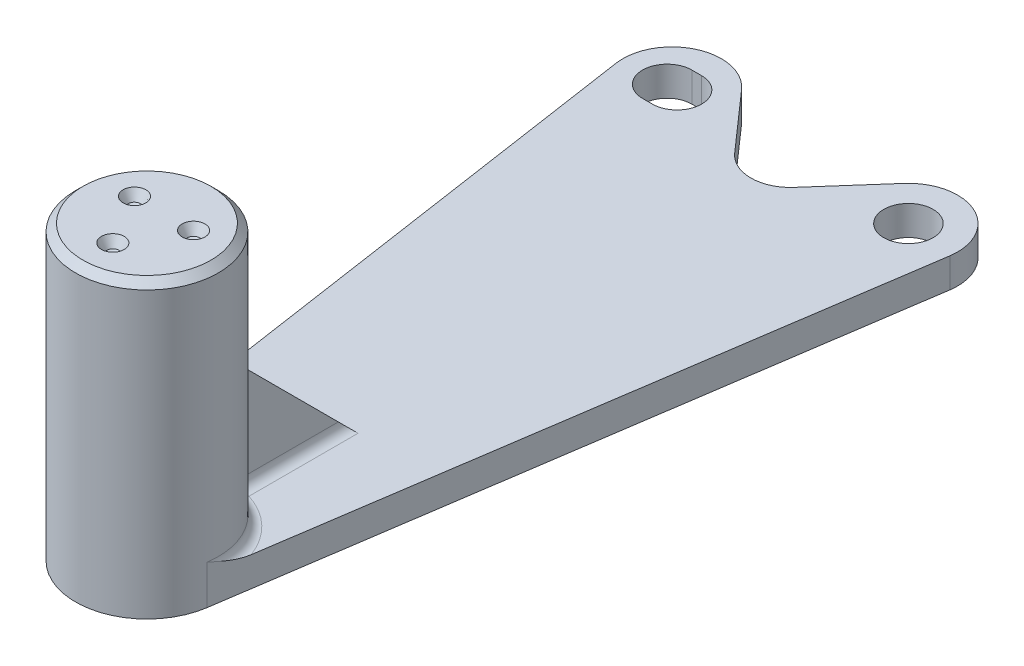
ISO-10303-21;
HEADER;
FILE_DESCRIPTION(('STEP AP214'),'2;1');
FILE_NAME('part.step','',(''),(''),'','','');
FILE_SCHEMA(('AUTOMOTIVE_DESIGN { 1 0 10303 214 1 1 1 1 }'));
ENDSEC;
DATA;
#1=APPLICATION_CONTEXT('core data for automotive mechanical design processes');
#2=APPLICATION_PROTOCOL_DEFINITION('international standard','automotive_design',2000,#1);
#3=PRODUCT_CONTEXT('',#1,'mechanical');
#4=PRODUCT('Part','Part','',(#3));
#5=PRODUCT_RELATED_PRODUCT_CATEGORY('part','',(#4));
#6=PRODUCT_DEFINITION_FORMATION('','',#4);
#7=PRODUCT_DEFINITION_CONTEXT('part definition',#1,'design');
#8=PRODUCT_DEFINITION('design','',#6,#7);
#9=PRODUCT_DEFINITION_SHAPE('','',#8);
#10=(LENGTH_UNIT() NAMED_UNIT(*) SI_UNIT(.MILLI.,.METRE.));
#11=(NAMED_UNIT(*) PLANE_ANGLE_UNIT() SI_UNIT($,.RADIAN.));
#12=(NAMED_UNIT(*) SI_UNIT($,.STERADIAN.) SOLID_ANGLE_UNIT());
#13=UNCERTAINTY_MEASURE_WITH_UNIT(LENGTH_MEASURE(1.E-05),#10,'distance_accuracy_value','');
#14=(GEOMETRIC_REPRESENTATION_CONTEXT(3) GLOBAL_UNCERTAINTY_ASSIGNED_CONTEXT((#13)) GLOBAL_UNIT_ASSIGNED_CONTEXT((#10,
#11,#12)) REPRESENTATION_CONTEXT('',''));
#15=CARTESIAN_POINT('',(0.,0.,0.));
#16=DIRECTION('',(0.,0.,1.));
#17=DIRECTION('',(1.,0.,0.));
#18=AXIS2_PLACEMENT_3D('',#15,#16,#17);
#19=CARTESIAN_POINT('',(0.,-119.23719330882,200.655577655365));
#20=DIRECTION('',(0.,1.,0.));
#21=DIRECTION('',(0.,0.,1.));
#22=AXIS2_PLACEMENT_3D('',#19,#20,#21);
#23=CYLINDRICAL_SURFACE('',#22,14.5);
#24=CARTESIAN_POINT('',(0.,-20.3479111694278,200.655577655365));
#25=DIRECTION('',(0.,1.,0.));
#26=DIRECTION('',(0.,0.,1.));
#27=AXIS2_PLACEMENT_3D('',#24,#25,#26);
#28=CIRCLE('',#27,14.5);
#29=CARTESIAN_POINT('',(0.,-20.3479111694278,186.155577655365));
#30=VERTEX_POINT('',#29);
#31=EDGE_CURVE('E317',#30,#30,#28,.F.);
#32=ORIENTED_EDGE('',*,*,#31,.T.);
#33=EDGE_LOOP('',(#32));
#34=FACE_BOUND('',#33,.T.);
#35=DIRECTION('',(0.,-1.,0.));
#36=VECTOR('',#35,1.);
#37=CARTESIAN_POINT('',(14.3419504002257,-72.225,202.790632389433));
#38=LINE('',#37,#36);
#39=CARTESIAN_POINT('',(14.3419504002258,-70.225,202.790632389433));
#40=VERTEX_POINT('',#39);
#41=CARTESIAN_POINT('',(14.3419504002258,-78.225,202.790632389433));
#42=VERTEX_POINT('',#41);
#43=EDGE_CURVE('E207',#40,#42,#38,.T.);
#44=ORIENTED_EDGE('',*,*,#43,.F.);
#45=CARTESIAN_POINT('',(0.,-70.225,200.655577655365));
#46=DIRECTION('',(0.,-1.,0.));
#47=DIRECTION('',(0.,0.,-1.));
#48=AXIS2_PLACEMENT_3D('',#45,#46,#47);
#49=CIRCLE('',#48,14.5);
#50=CARTESIAN_POINT('',(4.39393939393936,-70.225,186.837354303487));
#51=VERTEX_POINT('',#50);
#52=EDGE_CURVE('E341',#40,#51,#49,.F.);
#53=ORIENTED_EDGE('',*,*,#52,.T.);
#54=DIRECTION('',(0.,1.,0.));
#55=VECTOR('',#54,1.);
#56=CARTESIAN_POINT('',(4.39393939393936,-119.23719330882,186.837354303487));
#57=LINE('',#56,#55);
#58=CARTESIAN_POINT('',(4.39393939393936,-48.1782780859458,186.837354303487));
#59=VERTEX_POINT('',#58);
#60=EDGE_CURVE('E338',#51,#59,#57,.T.);
#61=ORIENTED_EDGE('',*,*,#60,.T.);
#62=CARTESIAN_POINT('',(0.,-34.3600547340679,200.655577655365));
#63=DIRECTION('',(0.,0.707106781186551,-0.707106781186544));
#64=DIRECTION('',(0.,0.707106781186544,0.707106781186551));
#65=AXIS2_PLACEMENT_3D('',#62,#63,#64);
#66=ELLIPSE('',#65,20.5060966544098,14.5);
#67=CARTESIAN_POINT('',(-4.39393939393943,-48.1782780859458,186.837354303487));
#68=VERTEX_POINT('',#67);
#69=EDGE_CURVE('E219',#68,#59,#66,.F.);
#70=ORIENTED_EDGE('',*,*,#69,.F.);
#71=DIRECTION('',(0.,1.,0.));
#72=VECTOR('',#71,1.);
#73=CARTESIAN_POINT('',(-4.39393939393943,-119.23719330882,186.837354303487));
#74=LINE('',#73,#72);
#75=CARTESIAN_POINT('',(-4.39393939393943,-70.225,186.837354303487));
#76=VERTEX_POINT('',#75);
#77=EDGE_CURVE('E333',#68,#76,#74,.F.);
#78=ORIENTED_EDGE('',*,*,#77,.T.);
#79=CARTESIAN_POINT('',(0.,-70.225,200.655577655365));
#80=DIRECTION('',(0.,-1.,0.));
#81=DIRECTION('',(0.,0.,-1.));
#82=AXIS2_PLACEMENT_3D('',#79,#80,#81);
#83=CIRCLE('',#82,14.5);
#84=CARTESIAN_POINT('',(-14.3419504002258,-70.225,202.790632389433));
#85=VERTEX_POINT('',#84);
#86=EDGE_CURVE('E335',#76,#85,#83,.F.);
#87=ORIENTED_EDGE('',*,*,#86,.T.);
#88=DIRECTION('',(0.,-1.,0.));
#89=VECTOR('',#88,1.);
#90=CARTESIAN_POINT('',(-14.3419504002257,-72.225,202.790632389433));
#91=LINE('',#90,#89);
#92=CARTESIAN_POINT('',(-14.3419504002257,-78.225,202.790632389433));
#93=VERTEX_POINT('',#92);
#94=EDGE_CURVE('E291',#85,#93,#91,.T.);
#95=ORIENTED_EDGE('',*,*,#94,.T.);
#96=CARTESIAN_POINT('',(0.,-78.225,200.655577655365));
#97=DIRECTION('',(0.,-1.,0.));
#98=DIRECTION('',(0.,0.,-1.));
#99=AXIS2_PLACEMENT_3D('',#96,#97,#98);
#100=CIRCLE('',#99,14.5);
#101=EDGE_CURVE('E312',#93,#42,#100,.F.);
#102=ORIENTED_EDGE('',*,*,#101,.T.);
#103=EDGE_LOOP('',(#44,#53,#61,#70,#78,#87,#95,#102));
#104=FACE_BOUND('',#103,.T.);
#105=ADVANCED_FACE('F45',(#34,#104),#23,.T.);
#106=CARTESIAN_POINT('',(0.,-72.225,0.));
#107=DIRECTION('',(0.,-1.,0.));
#108=DIRECTION('',(0.,0.,-1.));
#109=AXIS2_PLACEMENT_3D('',#106,#107,#108);
#110=PLANE('',#109);
#111=CARTESIAN_POINT('',(24.,-72.225,70.));
#112=DIRECTION('',(0.,-1.,0.));
#113=DIRECTION('',(0.,0.,-1.));
#114=AXIS2_PLACEMENT_3D('',#111,#112,#113);
#115=CIRCLE('',#114,5.);
#116=CARTESIAN_POINT('',(24.,-72.225,65.));
#117=VERTEX_POINT('',#116);
#118=EDGE_CURVE('E208',#117,#117,#115,.T.);
#119=ORIENTED_EDGE('',*,*,#118,.T.);
#120=EDGE_LOOP('',(#119));
#121=FACE_BOUND('',#120,.T.);
#122=CARTESIAN_POINT('',(-25.,-72.225,70.));
#123=DIRECTION('',(0.,-1.,0.));
#124=DIRECTION('',(0.,0.,-1.));
#125=AXIS2_PLACEMENT_3D('',#122,#123,#124);
#126=CIRCLE('',#125,5.);
#127=CARTESIAN_POINT('',(-25.,-72.225,75.));
#128=VERTEX_POINT('',#127);
#129=CARTESIAN_POINT('',(-25.,-72.225,65.));
#130=VERTEX_POINT('',#129);
#131=EDGE_CURVE('E233',#128,#130,#126,.T.);
#132=ORIENTED_EDGE('',*,*,#131,.T.);
#133=DIRECTION('',(-1.,0.,0.));
#134=VECTOR('',#133,1.);
#135=CARTESIAN_POINT('',(0.,-72.225,65.));
#136=LINE('',#135,#134);
#137=CARTESIAN_POINT('',(-23.,-72.225,65.));
#138=VERTEX_POINT('',#137);
#139=EDGE_CURVE('E239',#138,#130,#136,.T.);
#140=ORIENTED_EDGE('',*,*,#139,.F.);
#141=CARTESIAN_POINT('',(-23.,-72.225,70.));
#142=DIRECTION('',(0.,-1.,0.));
#143=DIRECTION('',(0.,0.,-1.));
#144=AXIS2_PLACEMENT_3D('',#141,#142,#143);
#145=CIRCLE('',#144,5.);
#146=CARTESIAN_POINT('',(-23.,-72.225,75.));
#147=VERTEX_POINT('',#146);
#148=EDGE_CURVE('E237',#138,#147,#145,.T.);
#149=ORIENTED_EDGE('',*,*,#148,.T.);
#150=DIRECTION('',(-1.,0.,0.));
#151=VECTOR('',#150,1.);
#152=CARTESIAN_POINT('',(0.,-72.225,75.));
#153=LINE('',#152,#151);
#154=EDGE_CURVE('E235',#147,#128,#153,.T.);
#155=ORIENTED_EDGE('',*,*,#154,.T.);
#156=EDGE_LOOP('',(#132,#140,#149,#155));
#157=FACE_BOUND('',#156,.T.);
#158=DIRECTION('',(-1.,0.,0.));
#159=VECTOR('',#158,1.);
#160=CARTESIAN_POINT('',(2.99999999999997,-72.225,162.790632389433));
#161=LINE('',#160,#159);
#162=CARTESIAN_POINT('',(4.99999999999997,-72.225,162.790632389433));
#163=VERTEX_POINT('',#162);
#164=CARTESIAN_POINT('',(-5.00000000000003,-72.225,162.790632389433));
#165=VERTEX_POINT('',#164);
#166=EDGE_CURVE('E501',#163,#165,#161,.T.);
#167=ORIENTED_EDGE('',*,*,#166,.F.);
#168=DIRECTION('',(0.,0.,-1.));
#169=VECTOR('',#168,1.);
#170=CARTESIAN_POINT('',(4.99999999999997,-72.225,186.469316696254));
#171=LINE('',#170,#169);
#172=CARTESIAN_POINT('',(4.99999999999997,-72.225,184.931392461849));
#173=VERTEX_POINT('',#172);
#174=EDGE_CURVE('E331',#163,#173,#171,.F.);
#175=ORIENTED_EDGE('',*,*,#174,.T.);
#176=CARTESIAN_POINT('',(0.,-72.225,200.655577655365));
#177=DIRECTION('',(0.,-1.,0.));
#178=DIRECTION('',(0.,0.,-1.));
#179=AXIS2_PLACEMENT_3D('',#176,#177,#178);
#180=CIRCLE('',#179,16.5);
#181=CARTESIAN_POINT('',(15.5013599028115,-72.225,195.002450983911));
#182=VERTEX_POINT('',#181);
#183=EDGE_CURVE('E192',#173,#182,#180,.T.);
#184=ORIENTED_EDGE('',*,*,#183,.T.);
#185=DIRECTION('',(0.147245154073624,0.,-0.989100027601776));
#186=VECTOR('',#185,1.);
#187=CARTESIAN_POINT('',(43.5654660435533,-72.225,6.48549548161062));
#188=LINE('',#187,#186);
#189=CARTESIAN_POINT('',(33.8910002760177,-72.225,71.4724515407363));
#190=VERTEX_POINT('',#189);
#191=EDGE_CURVE('E184',#182,#190,#188,.T.);
#192=ORIENTED_EDGE('',*,*,#191,.T.);
#193=CARTESIAN_POINT('',(24.,-72.225,70.));
#194=DIRECTION('',(0.,-1.,0.));
#195=DIRECTION('',(0.,0.,-1.));
#196=AXIS2_PLACEMENT_3D('',#193,#194,#195);
#197=CIRCLE('',#196,10.);
#198=CARTESIAN_POINT('',(16.5,-72.225,63.3856217223385));
#199=VERTEX_POINT('',#198);
#200=EDGE_CURVE('E189',#190,#199,#197,.F.);
#201=ORIENTED_EDGE('',*,*,#200,.T.);
#202=DIRECTION('',(0.661437827766147,0.,-0.75));
#203=VECTOR('',#202,1.);
#204=CARTESIAN_POINT('',(40.7254859577228,-72.225,35.9165026221292));
#205=LINE('',#204,#203);
#206=CARTESIAN_POINT('',(6.00000000000001,-72.225,75.2915026221292));
#207=VERTEX_POINT('',#206);
#208=EDGE_CURVE('E231',#207,#199,#205,.T.);
#209=ORIENTED_EDGE('',*,*,#208,.F.);
#210=CARTESIAN_POINT('',(0.,-72.225,70.));
#211=DIRECTION('',(0.,-1.,0.));
#212=DIRECTION('',(0.,0.,-1.));
#213=AXIS2_PLACEMENT_3D('',#210,#211,#212);
#214=CIRCLE('',#213,8.);
#215=CARTESIAN_POINT('',(-6.00000000000001,-72.225,75.2915026221292));
#216=VERTEX_POINT('',#215);
#217=EDGE_CURVE('E228',#216,#207,#214,.F.);
#218=ORIENTED_EDGE('',*,*,#217,.F.);
#219=DIRECTION('',(-0.661437827766147,0.,-0.75));
#220=VECTOR('',#219,1.);
#221=CARTESIAN_POINT('',(-40.7254859577228,-72.225,35.9165026221292));
#222=LINE('',#221,#220);
#223=CARTESIAN_POINT('',(-16.5,-72.225,63.3856217223385));
#224=VERTEX_POINT('',#223);
#225=EDGE_CURVE('E226',#216,#224,#222,.T.);
#226=ORIENTED_EDGE('',*,*,#225,.T.);
#227=CARTESIAN_POINT('',(-24.,-72.225,70.));
#228=DIRECTION('',(0.,-1.,0.));
#229=DIRECTION('',(0.,0.,-1.));
#230=AXIS2_PLACEMENT_3D('',#227,#228,#229);
#231=CIRCLE('',#230,10.);
#232=CARTESIAN_POINT('',(-33.8910002760177,-72.225,71.4724515407363));
#233=VERTEX_POINT('',#232);
#234=EDGE_CURVE('E223',#233,#224,#231,.T.);
#235=ORIENTED_EDGE('',*,*,#234,.F.);
#236=DIRECTION('',(-0.147245154073624,0.,-0.989100027601776));
#237=VECTOR('',#236,1.);
#238=CARTESIAN_POINT('',(-43.5654660435533,-72.225,6.48549548161062));
#239=LINE('',#238,#237);
#240=CARTESIAN_POINT('',(-15.5013599028115,-72.225,195.002450983911));
#241=VERTEX_POINT('',#240);
#242=EDGE_CURVE('E196',#241,#233,#239,.T.);
#243=ORIENTED_EDGE('',*,*,#242,.F.);
#244=CARTESIAN_POINT('',(0.,-72.225,200.655577655365));
#245=DIRECTION('',(0.,-1.,0.));
#246=DIRECTION('',(0.,0.,-1.));
#247=AXIS2_PLACEMENT_3D('',#244,#245,#246);
#248=CIRCLE('',#247,16.5);
#249=CARTESIAN_POINT('',(-5.00000000000003,-72.225,184.931392461849));
#250=VERTEX_POINT('',#249);
#251=EDGE_CURVE('E325',#241,#250,#248,.T.);
#252=ORIENTED_EDGE('',*,*,#251,.T.);
#253=DIRECTION('',(0.,0.,-1.));
#254=VECTOR('',#253,1.);
#255=CARTESIAN_POINT('',(-5.00000000000003,-72.225,0.));
#256=LINE('',#255,#254);
#257=EDGE_CURVE('E327',#250,#165,#256,.T.);
#258=ORIENTED_EDGE('',*,*,#257,.T.);
#259=EDGE_LOOP('',(#167,#175,#184,#192,#201,#209,#218,#226,#235,#243,#252,#258));
#260=FACE_BOUND('',#259,.T.);
#261=ADVANCED_FACE('F186',(#121,#157,#260),#110,.F.);
#262=CARTESIAN_POINT('',(0.,-78.225,-233.553390593275));
#263=DIRECTION('',(0.,-1.,0.));
#264=DIRECTION('',(0.,0.,-1.));
#265=AXIS2_PLACEMENT_3D('',#262,#263,#264);
#266=PLANE('',#265);
#267=ORIENTED_EDGE('',*,*,#101,.F.);
#268=DIRECTION('',(-0.147245154073624,0.,-0.989100027601776));
#269=VECTOR('',#268,1.);
#270=CARTESIAN_POINT('',(-43.5654660435533,-78.225,6.48549548161062));
#271=LINE('',#270,#269);
#272=CARTESIAN_POINT('',(-33.8910002760177,-78.225,71.4724515407363));
#273=VERTEX_POINT('',#272);
#274=EDGE_CURVE('E247',#93,#273,#271,.T.);
#275=ORIENTED_EDGE('',*,*,#274,.T.);
#276=CARTESIAN_POINT('',(-24.,-78.225,70.));
#277=DIRECTION('',(0.,-1.,0.));
#278=DIRECTION('',(0.,0.,-1.));
#279=AXIS2_PLACEMENT_3D('',#276,#277,#278);
#280=CIRCLE('',#279,10.);
#281=CARTESIAN_POINT('',(-16.5,-78.225,63.3856217223385));
#282=VERTEX_POINT('',#281);
#283=EDGE_CURVE('E250',#273,#282,#280,.T.);
#284=ORIENTED_EDGE('',*,*,#283,.T.);
#285=DIRECTION('',(-0.661437827766147,0.,-0.75));
#286=VECTOR('',#285,1.);
#287=CARTESIAN_POINT('',(-40.7254859577228,-78.225,35.9165026221292));
#288=LINE('',#287,#286);
#289=CARTESIAN_POINT('',(-6.00000000000001,-78.225,75.2915026221292));
#290=VERTEX_POINT('',#289);
#291=EDGE_CURVE('E253',#290,#282,#288,.T.);
#292=ORIENTED_EDGE('',*,*,#291,.F.);
#293=CARTESIAN_POINT('',(0.,-78.225,70.));
#294=DIRECTION('',(0.,-1.,0.));
#295=DIRECTION('',(0.,0.,-1.));
#296=AXIS2_PLACEMENT_3D('',#293,#294,#295);
#297=CIRCLE('',#296,8.);
#298=CARTESIAN_POINT('',(6.00000000000001,-78.225,75.2915026221292));
#299=VERTEX_POINT('',#298);
#300=EDGE_CURVE('E256',#290,#299,#297,.F.);
#301=ORIENTED_EDGE('',*,*,#300,.T.);
#302=DIRECTION('',(0.661437827766147,0.,-0.75));
#303=VECTOR('',#302,1.);
#304=CARTESIAN_POINT('',(40.7254859577228,-78.225,35.9165026221292));
#305=LINE('',#304,#303);
#306=CARTESIAN_POINT('',(16.5,-78.225,63.3856217223385));
#307=VERTEX_POINT('',#306);
#308=EDGE_CURVE('E259',#299,#307,#305,.T.);
#309=ORIENTED_EDGE('',*,*,#308,.T.);
#310=CARTESIAN_POINT('',(24.,-78.225,70.));
#311=DIRECTION('',(0.,-1.,0.));
#312=DIRECTION('',(0.,0.,-1.));
#313=AXIS2_PLACEMENT_3D('',#310,#311,#312);
#314=CIRCLE('',#313,10.);
#315=CARTESIAN_POINT('',(33.8910002760177,-78.225,71.4724515407363));
#316=VERTEX_POINT('',#315);
#317=EDGE_CURVE('E244',#316,#307,#314,.F.);
#318=ORIENTED_EDGE('',*,*,#317,.F.);
#319=DIRECTION('',(0.147245154073624,0.,-0.989100027601776));
#320=VECTOR('',#319,1.);
#321=CARTESIAN_POINT('',(43.5654660435533,-78.225,6.48549548161062));
#322=LINE('',#321,#320);
#323=EDGE_CURVE('E203',#42,#316,#322,.T.);
#324=ORIENTED_EDGE('',*,*,#323,.F.);
#325=EDGE_LOOP('',(#267,#275,#284,#292,#301,#309,#318,#324));
#326=FACE_BOUND('',#325,.T.);
#327=CARTESIAN_POINT('',(-25.,-78.225,70.));
#328=DIRECTION('',(0.,-1.,0.));
#329=DIRECTION('',(0.,0.,-1.));
#330=AXIS2_PLACEMENT_3D('',#327,#328,#329);
#331=CIRCLE('',#330,5.);
#332=CARTESIAN_POINT('',(-25.,-78.225,75.));
#333=VERTEX_POINT('',#332);
#334=CARTESIAN_POINT('',(-25.,-78.225,65.));
#335=VERTEX_POINT('',#334);
#336=EDGE_CURVE('E262',#333,#335,#331,.T.);
#337=ORIENTED_EDGE('',*,*,#336,.F.);
#338=DIRECTION('',(-1.,0.,0.));
#339=VECTOR('',#338,1.);
#340=CARTESIAN_POINT('',(0.,-78.225,75.));
#341=LINE('',#340,#339);
#342=CARTESIAN_POINT('',(-23.,-78.225,75.));
#343=VERTEX_POINT('',#342);
#344=EDGE_CURVE('E265',#343,#333,#341,.T.);
#345=ORIENTED_EDGE('',*,*,#344,.F.);
#346=CARTESIAN_POINT('',(-23.,-78.225,70.));
#347=DIRECTION('',(0.,-1.,0.));
#348=DIRECTION('',(0.,0.,-1.));
#349=AXIS2_PLACEMENT_3D('',#346,#347,#348);
#350=CIRCLE('',#349,5.);
#351=CARTESIAN_POINT('',(-23.,-78.225,65.));
#352=VERTEX_POINT('',#351);
#353=EDGE_CURVE('E267',#352,#343,#350,.T.);
#354=ORIENTED_EDGE('',*,*,#353,.F.);
#355=DIRECTION('',(-1.,0.,0.));
#356=VECTOR('',#355,1.);
#357=CARTESIAN_POINT('',(0.,-78.225,65.));
#358=LINE('',#357,#356);
#359=EDGE_CURVE('E216',#352,#335,#358,.T.);
#360=ORIENTED_EDGE('',*,*,#359,.T.);
#361=EDGE_LOOP('',(#337,#345,#354,#360));
#362=FACE_BOUND('',#361,.T.);
#363=CARTESIAN_POINT('',(24.,-78.225,70.));
#364=DIRECTION('',(0.,-1.,0.));
#365=DIRECTION('',(0.,0.,-1.));
#366=AXIS2_PLACEMENT_3D('',#363,#364,#365);
#367=CIRCLE('',#366,5.);
#368=CARTESIAN_POINT('',(24.,-78.225,65.));
#369=VERTEX_POINT('',#368);
#370=EDGE_CURVE('E213',#369,#369,#367,.T.);
#371=ORIENTED_EDGE('',*,*,#370,.F.);
#372=EDGE_LOOP('',(#371));
#373=FACE_BOUND('',#372,.T.);
#374=ADVANCED_FACE('F433',(#326,#362,#373),#266,.T.);
#375=CARTESIAN_POINT('',(0.,-18.8479111694278,200.655577655365));
#376=DIRECTION('',(0.,1.,0.));
#377=DIRECTION('',(0.,0.,1.));
#378=AXIS2_PLACEMENT_3D('',#375,#376,#377);
#379=PLANE('',#378);
#380=CARTESIAN_POINT('',(0.,-18.8479111694278,200.655577655365));
#381=DIRECTION('',(0.,1.,0.));
#382=DIRECTION('',(0.,0.,1.));
#383=AXIS2_PLACEMENT_3D('',#380,#381,#382);
#384=CIRCLE('',#383,13.);
#385=CARTESIAN_POINT('',(0.,-18.8479111694278,187.655577655365));
#386=VERTEX_POINT('',#385);
#387=EDGE_CURVE('E314',#386,#386,#384,.T.);
#388=ORIENTED_EDGE('',*,*,#387,.T.);
#389=EDGE_LOOP('',(#388));
#390=FACE_BOUND('',#389,.T.);
#391=CARTESIAN_POINT('',(-6.00000000000001,-18.8479111694278,197.191476040227));
#392=DIRECTION('',(0.,1.,0.));
#393=DIRECTION('',(-0.866025403784443,0.,-0.499999999999992));
#394=AXIS2_PLACEMENT_3D('',#391,#392,#393);
#395=CIRCLE('',#394,2.30940107675848);
#396=CARTESIAN_POINT('',(-8.,-18.8479111694278,196.036775501848));
#397=VERTEX_POINT('',#396);
#398=EDGE_CURVE('E273',#397,#397,#395,.T.);
#399=ORIENTED_EDGE('',*,*,#398,.F.);
#400=EDGE_LOOP('',(#399));
#401=FACE_BOUND('',#400,.T.);
#402=CARTESIAN_POINT('',(5.99999999999995,-18.8479111694278,197.191476040227));
#403=DIRECTION('',(0.,1.,0.));
#404=DIRECTION('',(0.866025403784436,0.,-0.500000000000004));
#405=AXIS2_PLACEMENT_3D('',#402,#403,#404);
#406=CIRCLE('',#405,2.30940107675848);
#407=CARTESIAN_POINT('',(7.99999999999992,-18.8479111694278,196.036775501848));
#408=VERTEX_POINT('',#407);
#409=EDGE_CURVE('E300',#408,#408,#406,.T.);
#410=ORIENTED_EDGE('',*,*,#409,.F.);
#411=EDGE_LOOP('',(#410));
#412=FACE_BOUND('',#411,.T.);
#413=CARTESIAN_POINT('',(0.,-18.8479111694278,207.583780885641));
#414=DIRECTION('',(0.,1.,0.));
#415=DIRECTION('',(0.,0.,1.));
#416=AXIS2_PLACEMENT_3D('',#413,#414,#415);
#417=CIRCLE('',#416,2.30940107675848);
#418=CARTESIAN_POINT('',(0.,-18.8479111694278,209.893181962399));
#419=VERTEX_POINT('',#418);
#420=EDGE_CURVE('E306',#419,#419,#417,.T.);
#421=ORIENTED_EDGE('',*,*,#420,.F.);
#422=EDGE_LOOP('',(#421));
#423=FACE_BOUND('',#422,.T.);
#424=ADVANCED_FACE('F452',(#390,#401,#412,#423),#379,.T.);
#425=CARTESIAN_POINT('',(0.,-18.8479111694278,207.583780885641));
#426=DIRECTION('',(0.,1.,0.));
#427=DIRECTION('',(0.,0.,1.));
#428=AXIS2_PLACEMENT_3D('',#425,#426,#427);
#429=SPHERICAL_SURFACE('',#428,2.25);
#430=CARTESIAN_POINT('',(0.,-20.7405897229956,207.583780885641));
#431=DIRECTION('',(0.,1.,0.));
#432=DIRECTION('',(0.,0.,1.));
#433=AXIS2_PLACEMENT_3D('',#430,#431,#432);
#434=CIRCLE('',#433,1.2166626043667);
#435=CARTESIAN_POINT('',(0.,-20.7405897229956,208.800443490007));
#436=VERTEX_POINT('',#435);
#437=EDGE_CURVE('E309',#436,#436,#434,.T.);
#438=ORIENTED_EDGE('',*,*,#437,.T.);
#439=EDGE_LOOP('',(#438));
#440=FACE_BOUND('',#439,.T.);
#441=ADVANCED_FACE('F727',(#440),#429,.F.);
#442=CARTESIAN_POINT('',(0.,-18.8479111694278,207.583780885641));
#443=DIRECTION('',(0.,1.,0.));
#444=DIRECTION('',(0.,0.,1.));
#445=AXIS2_PLACEMENT_3D('',#442,#443,#444);
#446=CONICAL_SURFACE('',#445,2.30940107675848,0.523598775598279);
#447=ORIENTED_EDGE('',*,*,#437,.F.);
#448=EDGE_LOOP('',(#447));
#449=FACE_BOUND('',#448,.T.);
#450=ORIENTED_EDGE('',*,*,#420,.T.);
#451=EDGE_LOOP('',(#450));
#452=FACE_BOUND('',#451,.T.);
#453=ADVANCED_FACE('F718',(#449,#452),#446,.F.);
#454=CARTESIAN_POINT('',(5.99999999999995,-18.8479111694278,197.191476040227));
#455=DIRECTION('',(0.,1.,0.));
#456=DIRECTION('',(0.866025403784436,0.,-0.500000000000004));
#457=AXIS2_PLACEMENT_3D('',#454,#455,#456);
#458=SPHERICAL_SURFACE('',#457,2.25);
#459=CARTESIAN_POINT('',(5.99999999999995,-20.7405897229956,197.191476040227));
#460=DIRECTION('',(0.,1.,0.));
#461=DIRECTION('',(0.866025403784436,0.,-0.500000000000004));
#462=AXIS2_PLACEMENT_3D('',#459,#460,#461);
#463=CIRCLE('',#462,1.2166626043667);
#464=CARTESIAN_POINT('',(7.05366072321604,-20.7405897229956,196.583144738044));
#465=VERTEX_POINT('',#464);
#466=EDGE_CURVE('E303',#465,#465,#463,.T.);
#467=ORIENTED_EDGE('',*,*,#466,.T.);
#468=EDGE_LOOP('',(#467));
#469=FACE_BOUND('',#468,.T.);
#470=ADVANCED_FACE('F709',(#469),#458,.F.);
#471=CARTESIAN_POINT('',(5.99999999999995,-18.8479111694278,197.191476040227));
#472=DIRECTION('',(0.,1.,0.));
#473=DIRECTION('',(0.866025403784436,0.,-0.500000000000004));
#474=AXIS2_PLACEMENT_3D('',#471,#472,#473);
#475=CONICAL_SURFACE('',#474,2.30940107675848,0.523598775598279);
#476=ORIENTED_EDGE('',*,*,#466,.F.);
#477=EDGE_LOOP('',(#476));
#478=FACE_BOUND('',#477,.T.);
#479=ORIENTED_EDGE('',*,*,#409,.T.);
#480=EDGE_LOOP('',(#479));
#481=FACE_BOUND('',#480,.T.);
#482=ADVANCED_FACE('F700',(#478,#481),#475,.F.);
#483=CARTESIAN_POINT('',(-6.00000000000001,-18.8479111694278,197.191476040227));
#484=DIRECTION('',(0.,1.,0.));
#485=DIRECTION('',(-0.866025403784443,0.,-0.499999999999992));
#486=AXIS2_PLACEMENT_3D('',#483,#484,#485);
#487=SPHERICAL_SURFACE('',#486,2.25);
#488=CARTESIAN_POINT('',(-6.00000000000001,-20.7405897229956,197.191476040227));
#489=DIRECTION('',(0.,1.,0.));
#490=DIRECTION('',(-0.866025403784443,0.,-0.499999999999992));
#491=AXIS2_PLACEMENT_3D('',#488,#489,#490);
#492=CIRCLE('',#491,1.2166626043667);
#493=CARTESIAN_POINT('',(-7.05366072321612,-20.7405897229956,196.583144738044));
#494=VERTEX_POINT('',#493);
#495=EDGE_CURVE('E297',#494,#494,#492,.T.);
#496=ORIENTED_EDGE('',*,*,#495,.T.);
#497=EDGE_LOOP('',(#496));
#498=FACE_BOUND('',#497,.T.);
#499=ADVANCED_FACE('F691',(#498),#487,.F.);
#500=CARTESIAN_POINT('',(-6.00000000000001,-18.8479111694278,197.191476040227));
#501=DIRECTION('',(0.,1.,0.));
#502=DIRECTION('',(-0.866025403784443,0.,-0.499999999999992));
#503=AXIS2_PLACEMENT_3D('',#500,#501,#502);
#504=CONICAL_SURFACE('',#503,2.30940107675848,0.523598775598279);
#505=ORIENTED_EDGE('',*,*,#495,.F.);
#506=EDGE_LOOP('',(#505));
#507=FACE_BOUND('',#506,.T.);
#508=ORIENTED_EDGE('',*,*,#398,.T.);
#509=EDGE_LOOP('',(#508));
#510=FACE_BOUND('',#509,.T.);
#511=ADVANCED_FACE('F462',(#507,#510),#504,.F.);
#512=CARTESIAN_POINT('',(0.,-18.8479111694278,200.655577655365));
#513=DIRECTION('',(0.,-1.,0.));
#514=DIRECTION('',(0.,0.,-1.));
#515=AXIS2_PLACEMENT_3D('',#512,#513,#514);
#516=CONICAL_SURFACE('',#515,13.,0.785398163397447);
#517=CARTESIAN_POINT('',(0.,-20.3479111694278,186.155577655365));
#518=CARTESIAN_POINT('',(0.,-20.3322861694278,186.171202655365));
#519=CARTESIAN_POINT('',(0.,-20.3166611694278,186.186827655365));
#520=CARTESIAN_POINT('',(0.,-20.2854111694278,186.218077655365));
#521=CARTESIAN_POINT('',(0.,-20.2697861694278,186.233702655365));
#522=CARTESIAN_POINT('',(0.,-20.2385361694278,186.264952655365));
#523=CARTESIAN_POINT('',(0.,-20.2229111694278,186.280577655365));
#524=CARTESIAN_POINT('',(0.,-20.1916611694278,186.311827655365));
#525=CARTESIAN_POINT('',(0.,-20.1760361694278,186.327452655365));
#526=CARTESIAN_POINT('',(0.,-20.1447861694278,186.358702655365));
#527=CARTESIAN_POINT('',(0.,-20.1291611694278,186.374327655365));
#528=CARTESIAN_POINT('',(0.,-20.0979111694278,186.405577655365));
#529=CARTESIAN_POINT('',(0.,-20.0822861694278,186.421202655365));
#530=CARTESIAN_POINT('',(0.,-20.0510361694278,186.452452655365));
#531=CARTESIAN_POINT('',(0.,-20.0354111694278,186.468077655365));
#532=CARTESIAN_POINT('',(0.,-20.0041611694278,186.499327655365));
#533=CARTESIAN_POINT('',(0.,-19.9885361694278,186.514952655365));
#534=CARTESIAN_POINT('',(0.,-19.9572861694278,186.546202655365));
#535=CARTESIAN_POINT('',(0.,-19.9416611694278,186.561827655365));
#536=CARTESIAN_POINT('',(0.,-19.9104111694278,186.593077655365));
#537=CARTESIAN_POINT('',(0.,-19.8947861694278,186.608702655365));
#538=CARTESIAN_POINT('',(0.,-19.8635361694278,186.639952655365));
#539=CARTESIAN_POINT('',(0.,-19.8479111694278,186.655577655365));
#540=CARTESIAN_POINT('',(0.,-19.8166611694278,186.686827655365));
#541=CARTESIAN_POINT('',(0.,-19.8010361694278,186.702452655365));
#542=CARTESIAN_POINT('',(0.,-19.7697861694278,186.733702655365));
#543=CARTESIAN_POINT('',(0.,-19.7541611694278,186.749327655365));
#544=CARTESIAN_POINT('',(0.,-19.7229111694278,186.780577655365));
#545=CARTESIAN_POINT('',(0.,-19.7072861694278,186.796202655365));
#546=CARTESIAN_POINT('',(0.,-19.6760361694278,186.827452655365));
#547=CARTESIAN_POINT('',(0.,-19.6604111694278,186.843077655365));
#548=CARTESIAN_POINT('',(0.,-19.6291611694278,186.874327655365));
#549=CARTESIAN_POINT('',(0.,-19.6135361694278,186.889952655365));
#550=CARTESIAN_POINT('',(0.,-19.5822861694278,186.921202655365));
#551=CARTESIAN_POINT('',(0.,-19.5666611694278,186.936827655365));
#552=CARTESIAN_POINT('',(0.,-19.5354111694278,186.968077655365));
#553=CARTESIAN_POINT('',(0.,-19.5197861694278,186.983702655365));
#554=CARTESIAN_POINT('',(0.,-19.4885361694278,187.014952655365));
#555=CARTESIAN_POINT('',(0.,-19.4729111694278,187.030577655365));
#556=CARTESIAN_POINT('',(0.,-19.4416611694278,187.061827655365));
#557=CARTESIAN_POINT('',(0.,-19.4260361694278,187.077452655365));
#558=CARTESIAN_POINT('',(0.,-19.3947861694278,187.108702655365));
#559=CARTESIAN_POINT('',(0.,-19.3791611694278,187.124327655365));
#560=CARTESIAN_POINT('',(0.,-19.3479111694278,187.155577655365));
#561=CARTESIAN_POINT('',(0.,-19.3322861694278,187.171202655365));
#562=CARTESIAN_POINT('',(0.,-19.3010361694278,187.202452655365));
#563=CARTESIAN_POINT('',(0.,-19.2854111694278,187.218077655365));
#564=CARTESIAN_POINT('',(0.,-19.2541611694278,187.249327655365));
#565=CARTESIAN_POINT('',(0.,-19.2385361694278,187.264952655365));
#566=CARTESIAN_POINT('',(0.,-19.2072861694278,187.296202655365));
#567=CARTESIAN_POINT('',(0.,-19.1916611694278,187.311827655365));
#568=CARTESIAN_POINT('',(0.,-19.1604111694278,187.343077655365));
#569=CARTESIAN_POINT('',(0.,-19.1447861694278,187.358702655365));
#570=CARTESIAN_POINT('',(0.,-19.1135361694278,187.389952655365));
#571=CARTESIAN_POINT('',(0.,-19.0979111694278,187.405577655365));
#572=CARTESIAN_POINT('',(0.,-19.0666611694278,187.436827655365));
#573=CARTESIAN_POINT('',(0.,-19.0510361694278,187.452452655365));
#574=CARTESIAN_POINT('',(0.,-19.0197861694278,187.483702655365));
#575=CARTESIAN_POINT('',(0.,-19.0041611694278,187.499327655365));
#576=CARTESIAN_POINT('',(0.,-18.9729111694278,187.530577655365));
#577=CARTESIAN_POINT('',(0.,-18.9572861694278,187.546202655365));
#578=CARTESIAN_POINT('',(0.,-18.9260361694278,187.577452655365));
#579=CARTESIAN_POINT('',(0.,-18.9104111694278,187.593077655365));
#580=CARTESIAN_POINT('',(0.,-18.8791611694278,187.624327655365));
#581=CARTESIAN_POINT('',(0.,-18.8635361694278,187.639952655365));
#582=CARTESIAN_POINT('',(0.,-18.8479111694278,187.655577655365));
#583=B_SPLINE_CURVE_WITH_KNOTS('',3,(#517,#518,#519,#520,#521,#522,#523,#524,#525,#526,#527,
#528,#529,#530,#531,#532,#533,#534,#535,#536,#537,#538,#539,#540,#541,#542,#543,#544,#545,#546,
#547,#548,#549,#550,#551,#552,#553,#554,#555,#556,#557,#558,#559,#560,#561,#562,#563,#564,#565,
#566,#567,#568,#569,#570,#571,#572,#573,#574,#575,#576,#577,#578,#579,#580,#581,#582),
.UNSPECIFIED.,.F.,.F.,(4,2,2,2,2,2,2,2,2,2,2,2,2,2,2,2,2,2,2,2,2,2,2,2,2,2,2,2,2,2,2,2,4),(0.,
0.0662912607362217,0.132582521472461,0.198873782208702,0.265165042944941,0.33145630368118,
0.397747564417421,0.46403882515366,0.530330085889901,0.59662134662614,0.662912607362382,
0.72920386809862,0.795495128834859,0.861786389571101,0.92807765030732,0.994368911043561,
1.0606601717798,1.12695143251604,1.19324269325228,1.25953395398852,1.32582521472476,
1.392116475461,1.45840773619724,1.52469899693348,1.59099025766972,1.65728151840596,
1.72357277914218,1.78986403987842,1.85615530061466,1.9224465613509,1.98873782208714,
2.05502908282338,2.12132034355962),.UNSPECIFIED.);
#584=EDGE_CURVE('BSEAM414',#30,#386,#583,.T.);
#585=ORIENTED_EDGE('',*,*,#31,.F.);
#586=ORIENTED_EDGE('',*,*,#387,.F.);
#587=ORIENTED_EDGE('',*,*,#584,.T.);
#588=ORIENTED_EDGE('',*,*,#584,.F.);
#589=EDGE_LOOP('',(#585,#587,#586,#588));
#590=FACE_BOUND('',#589,.T.);
#591=ADVANCED_FACE('F414',(#590),#516,.T.);
#592=CARTESIAN_POINT('',(-25.,-72.225,70.));
#593=DIRECTION('',(0.,-1.,0.));
#594=DIRECTION('',(0.,0.,-1.));
#595=AXIS2_PLACEMENT_3D('',#592,#593,#594);
#596=CYLINDRICAL_SURFACE('',#595,5.);
#597=ORIENTED_EDGE('',*,*,#336,.T.);
#598=DIRECTION('',(0.,-1.,0.));
#599=VECTOR('',#598,1.);
#600=CARTESIAN_POINT('',(-25.,-72.225,65.));
#601=LINE('',#600,#599);
#602=EDGE_CURVE('E271',#130,#335,#601,.T.);
#603=ORIENTED_EDGE('',*,*,#602,.F.);
#604=ORIENTED_EDGE('',*,*,#131,.F.);
#605=DIRECTION('',(0.,-1.,0.));
#606=VECTOR('',#605,1.);
#607=CARTESIAN_POINT('',(-25.,-72.225,75.));
#608=LINE('',#607,#606);
#609=EDGE_CURVE('E279',#128,#333,#608,.T.);
#610=ORIENTED_EDGE('',*,*,#609,.T.);
#611=EDGE_LOOP('',(#597,#603,#604,#610));
#612=FACE_BOUND('',#611,.T.);
#613=ADVANCED_FACE('F410',(#612),#596,.F.);
#614=CARTESIAN_POINT('',(0.,-72.225,65.));
#615=DIRECTION('',(0.,0.,1.));
#616=DIRECTION('',(1.,0.,0.));
#617=AXIS2_PLACEMENT_3D('',#614,#615,#616);
#618=PLANE('',#617);
#619=ORIENTED_EDGE('',*,*,#359,.F.);
#620=DIRECTION('',(0.,-1.,0.));
#621=VECTOR('',#620,1.);
#622=CARTESIAN_POINT('',(-23.,-72.225,65.));
#623=LINE('',#622,#621);
#624=EDGE_CURVE('E274',#138,#352,#623,.T.);
#625=ORIENTED_EDGE('',*,*,#624,.F.);
#626=ORIENTED_EDGE('',*,*,#139,.T.);
#627=ORIENTED_EDGE('',*,*,#602,.T.);
#628=EDGE_LOOP('',(#619,#625,#626,#627));
#629=FACE_BOUND('',#628,.T.);
#630=ADVANCED_FACE('F413',(#629),#618,.T.);
#631=CARTESIAN_POINT('',(-23.,-72.225,70.));
#632=DIRECTION('',(0.,-1.,0.));
#633=DIRECTION('',(0.,0.,-1.));
#634=AXIS2_PLACEMENT_3D('',#631,#632,#633);
#635=CYLINDRICAL_SURFACE('',#634,5.);
#636=ORIENTED_EDGE('',*,*,#353,.T.);
#637=DIRECTION('',(0.,-1.,0.));
#638=VECTOR('',#637,1.);
#639=CARTESIAN_POINT('',(-23.,-72.225,75.));
#640=LINE('',#639,#638);
#641=EDGE_CURVE('E276',#147,#343,#640,.T.);
#642=ORIENTED_EDGE('',*,*,#641,.F.);
#643=ORIENTED_EDGE('',*,*,#148,.F.);
#644=ORIENTED_EDGE('',*,*,#624,.T.);
#645=EDGE_LOOP('',(#636,#642,#643,#644));
#646=FACE_BOUND('',#645,.T.);
#647=ADVANCED_FACE('F419',(#646),#635,.F.);
#648=CARTESIAN_POINT('',(24.,-72.225,70.));
#649=DIRECTION('',(0.,-1.,0.));
#650=DIRECTION('',(0.,0.,-1.));
#651=AXIS2_PLACEMENT_3D('',#648,#649,#650);
#652=CYLINDRICAL_SURFACE('',#651,10.);
#653=ORIENTED_EDGE('',*,*,#317,.T.);
#654=DIRECTION('',(0.,-1.,0.));
#655=VECTOR('',#654,1.);
#656=CARTESIAN_POINT('',(16.5,-72.225,63.3856217223385));
#657=LINE('',#656,#655);
#658=EDGE_CURVE('E211',#199,#307,#657,.T.);
#659=ORIENTED_EDGE('',*,*,#658,.F.);
#660=ORIENTED_EDGE('',*,*,#200,.F.);
#661=DIRECTION('',(0.,-1.,0.));
#662=VECTOR('',#661,1.);
#663=CARTESIAN_POINT('',(33.8910002760177,-72.225,71.4724515407363));
#664=LINE('',#663,#662);
#665=EDGE_CURVE('E199',#190,#316,#664,.T.);
#666=ORIENTED_EDGE('',*,*,#665,.T.);
#667=EDGE_LOOP('',(#653,#659,#660,#666));
#668=FACE_BOUND('',#667,.T.);
#669=ADVANCED_FACE('F210',(#668),#652,.T.);
#670=CARTESIAN_POINT('',(40.7254859577228,-72.225,35.9165026221292));
#671=DIRECTION('',(-0.75,0.,-0.661437827766147));
#672=DIRECTION('',(-0.661437827766147,0.,0.75));
#673=AXIS2_PLACEMENT_3D('',#670,#671,#672);
#674=PLANE('',#673);
#675=ORIENTED_EDGE('',*,*,#308,.F.);
#676=DIRECTION('',(0.,-1.,0.));
#677=VECTOR('',#676,1.);
#678=CARTESIAN_POINT('',(6.00000000000001,-72.225,75.2915026221292));
#679=LINE('',#678,#677);
#680=EDGE_CURVE('E283',#207,#299,#679,.T.);
#681=ORIENTED_EDGE('',*,*,#680,.F.);
#682=ORIENTED_EDGE('',*,*,#208,.T.);
#683=ORIENTED_EDGE('',*,*,#658,.T.);
#684=EDGE_LOOP('',(#675,#681,#682,#683));
#685=FACE_BOUND('',#684,.T.);
#686=ADVANCED_FACE('F405',(#685),#674,.T.);
#687=CARTESIAN_POINT('',(0.,-72.225,70.));
#688=DIRECTION('',(0.,-1.,0.));
#689=DIRECTION('',(0.,0.,-1.));
#690=AXIS2_PLACEMENT_3D('',#687,#688,#689);
#691=CYLINDRICAL_SURFACE('',#690,8.);
#692=ORIENTED_EDGE('',*,*,#300,.F.);
#693=DIRECTION('',(0.,-1.,0.));
#694=VECTOR('',#693,1.);
#695=CARTESIAN_POINT('',(-6.00000000000001,-72.225,75.2915026221292));
#696=LINE('',#695,#694);
#697=EDGE_CURVE('E285',#216,#290,#696,.T.);
#698=ORIENTED_EDGE('',*,*,#697,.F.);
#699=ORIENTED_EDGE('',*,*,#217,.T.);
#700=ORIENTED_EDGE('',*,*,#680,.T.);
#701=EDGE_LOOP('',(#692,#698,#699,#700));
#702=FACE_BOUND('',#701,.T.);
#703=ADVANCED_FACE('F401',(#702),#691,.F.);
#704=CARTESIAN_POINT('',(-40.7254859577228,-72.225,35.9165026221292));
#705=DIRECTION('',(-0.75,0.,0.661437827766147));
#706=DIRECTION('',(0.661437827766147,0.,0.75));
#707=AXIS2_PLACEMENT_3D('',#704,#705,#706);
#708=PLANE('',#707);
#709=ORIENTED_EDGE('',*,*,#291,.T.);
#710=DIRECTION('',(0.,-1.,0.));
#711=VECTOR('',#710,1.);
#712=CARTESIAN_POINT('',(-16.5,-72.225,63.3856217223385));
#713=LINE('',#712,#711);
#714=EDGE_CURVE('E287',#224,#282,#713,.T.);
#715=ORIENTED_EDGE('',*,*,#714,.F.);
#716=ORIENTED_EDGE('',*,*,#225,.F.);
#717=ORIENTED_EDGE('',*,*,#697,.T.);
#718=EDGE_LOOP('',(#709,#715,#716,#717));
#719=FACE_BOUND('',#718,.T.);
#720=ADVANCED_FACE('F397',(#719),#708,.F.);
#721=CARTESIAN_POINT('',(-24.,-72.225,70.));
#722=DIRECTION('',(0.,-1.,0.));
#723=DIRECTION('',(0.,0.,-1.));
#724=AXIS2_PLACEMENT_3D('',#721,#722,#723);
#725=CYLINDRICAL_SURFACE('',#724,10.);
#726=ORIENTED_EDGE('',*,*,#283,.F.);
#727=DIRECTION('',(0.,-1.,0.));
#728=VECTOR('',#727,1.);
#729=CARTESIAN_POINT('',(-33.8910002760177,-72.225,71.4724515407363));
#730=LINE('',#729,#728);
#731=EDGE_CURVE('E289',#233,#273,#730,.T.);
#732=ORIENTED_EDGE('',*,*,#731,.F.);
#733=ORIENTED_EDGE('',*,*,#234,.T.);
#734=ORIENTED_EDGE('',*,*,#714,.T.);
#735=EDGE_LOOP('',(#726,#732,#733,#734));
#736=FACE_BOUND('',#735,.T.);
#737=ADVANCED_FACE('F393',(#736),#725,.T.);
#738=CARTESIAN_POINT('',(-43.5654660435533,-72.225,6.48549548161062));
#739=DIRECTION('',(-0.989100027601776,0.,0.147245154073624));
#740=DIRECTION('',(0.147245154073624,0.,0.989100027601776));
#741=AXIS2_PLACEMENT_3D('',#738,#739,#740);
#742=PLANE('',#741);
#743=ORIENTED_EDGE('',*,*,#274,.F.);
#744=ORIENTED_EDGE('',*,*,#94,.F.);
#745=CARTESIAN_POINT('',(-15.5013599028115,-72.225,195.002450983911));
#746=CARTESIAN_POINT('',(-15.4776151071572,-72.2249673014339,195.16195353722));
#747=CARTESIAN_POINT('',(-15.4538784744349,-72.2205603299847,195.321401257102));
#748=CARTESIAN_POINT('',(-15.4064766574299,-72.2040121538514,195.639816751337));
#749=CARTESIAN_POINT('',(-15.382811439154,-72.1918755319779,195.798784754034));
#750=CARTESIAN_POINT('',(-15.335641139471,-72.1609204864908,196.115645060996));
#751=CARTESIAN_POINT('',(-15.3121358010773,-72.1421196293367,196.273539091535));
#752=CARTESIAN_POINT('',(-15.26524096653,-72.0986367103053,196.588548997545));
#753=CARTESIAN_POINT('',(-15.241851490212,-72.0739536746559,196.745664739772));
#754=CARTESIAN_POINT('',(-15.1722725497792,-71.9926362178899,197.213052154561));
#755=CARTESIAN_POINT('',(-15.1262734888425,-71.9284458158848,197.522044818723));
#756=CARTESIAN_POINT('',(-15.0347888702587,-71.7844013378681,198.136580755988));
#757=CARTESIAN_POINT('',(-14.9893037295329,-71.7045353921477,198.442121228477));
#758=CARTESIAN_POINT('',(-14.8933143886099,-71.5224249693765,199.08691704776));
#759=CARTESIAN_POINT('',(-14.8428742161827,-71.4186393454831,199.4257422964));
#760=CARTESIAN_POINT('',(-14.7425111340899,-71.2004892349019,200.09991814886));
#761=CARTESIAN_POINT('',(-14.6925881215754,-71.0861268983575,200.435269443555));
#762=CARTESIAN_POINT('',(-14.5431751788009,-70.7324612902146,201.438931307688));
#763=CARTESIAN_POINT('',(-14.444216971741,-70.4829420810417,202.103670096206));
#764=CARTESIAN_POINT('',(-14.344166583033,-70.2305897796683,202.775745471831));
#765=CARTESIAN_POINT('',(-14.3430584911177,-70.2277948827007,202.783188934069));
#766=CARTESIAN_POINT('',(-14.3419504002257,-70.225,202.790632389433));
#767=B_SPLINE_CURVE_WITH_KNOTS('',3,(#745,#746,#747,#748,#749,#750,#751,#752,#753,#754,#755,
#756,#757,#758,#759,#760,#761,#762,#763,#764,#765,#766),.UNSPECIFIED.,.F.,.F.,(4,2,2,2,2,2,2,2,
2,2,4),(0.,0.483642251194568,0.966998023687575,1.4490890644803,1.93125996910314,
2.88744225414578,3.84435138471729,4.91790137997636,5.9912336106323,8.14163438221566,
8.16571757137653),.UNSPECIFIED.);
#768=EDGE_CURVE('E54',#85,#241,#767,.F.);
#769=ORIENTED_EDGE('',*,*,#768,.T.);
#770=ORIENTED_EDGE('',*,*,#242,.T.);
#771=ORIENTED_EDGE('',*,*,#731,.T.);
#772=EDGE_LOOP('',(#743,#744,#769,#770,#771));
#773=FACE_BOUND('',#772,.T.);
#774=ADVANCED_FACE('F388',(#773),#742,.T.);
#775=CARTESIAN_POINT('',(0.,-72.225,75.));
#776=DIRECTION('',(0.,0.,1.));
#777=DIRECTION('',(1.,0.,0.));
#778=AXIS2_PLACEMENT_3D('',#775,#776,#777);
#779=PLANE('',#778);
#780=ORIENTED_EDGE('',*,*,#344,.T.);
#781=ORIENTED_EDGE('',*,*,#609,.F.);
#782=ORIENTED_EDGE('',*,*,#154,.F.);
#783=ORIENTED_EDGE('',*,*,#641,.T.);
#784=EDGE_LOOP('',(#780,#781,#782,#783));
#785=FACE_BOUND('',#784,.T.);
#786=ADVANCED_FACE('F392',(#785),#779,.F.);
#787=CARTESIAN_POINT('',(43.5654660435533,-72.225,6.48549548161062));
#788=DIRECTION('',(-0.989100027601776,0.,-0.147245154073624));
#789=DIRECTION('',(-0.147245154073624,0.,0.989100027601776));
#790=AXIS2_PLACEMENT_3D('',#787,#788,#789);
#791=PLANE('',#790);
#792=ORIENTED_EDGE('',*,*,#323,.T.);
#793=ORIENTED_EDGE('',*,*,#665,.F.);
#794=ORIENTED_EDGE('',*,*,#191,.F.);
#795=CARTESIAN_POINT('',(15.5013599028115,-72.225,195.002450983911));
#796=CARTESIAN_POINT('',(15.4776151071572,-72.2249673014339,195.16195353722));
#797=CARTESIAN_POINT('',(15.4538784744349,-72.2205603299847,195.321401257102));
#798=CARTESIAN_POINT('',(15.4064766574299,-72.2040121538514,195.639816751337));
#799=CARTESIAN_POINT('',(15.382811439154,-72.1918755319779,195.798784754034));
#800=CARTESIAN_POINT('',(15.335641139471,-72.1609204864908,196.115645060996));
#801=CARTESIAN_POINT('',(15.3121358010773,-72.1421196293367,196.273539091535));
#802=CARTESIAN_POINT('',(15.26524096653,-72.0986367103053,196.588548997545));
#803=CARTESIAN_POINT('',(15.241851490212,-72.0739536746559,196.745664739772));
#804=CARTESIAN_POINT('',(15.1722725497792,-71.9926362178899,197.213052154561));
#805=CARTESIAN_POINT('',(15.1262734888425,-71.9284458158848,197.522044818723));
#806=CARTESIAN_POINT('',(15.0347888702587,-71.7844013378681,198.136580755988));
#807=CARTESIAN_POINT('',(14.9893037295329,-71.7045353921477,198.442121228477));
#808=CARTESIAN_POINT('',(14.8933143886099,-71.5224249693765,199.08691704776));
#809=CARTESIAN_POINT('',(14.8428742161827,-71.4186393454831,199.4257422964));
#810=CARTESIAN_POINT('',(14.7425111340899,-71.2004892349019,200.09991814886));
#811=CARTESIAN_POINT('',(14.6925881215754,-71.0861268983575,200.435269443555));
#812=CARTESIAN_POINT('',(14.5431751788009,-70.7324612902146,201.438931307688));
#813=CARTESIAN_POINT('',(14.444216971741,-70.4829420810417,202.103670096206));
#814=CARTESIAN_POINT('',(14.344166583033,-70.2305897796683,202.775745471831));
#815=CARTESIAN_POINT('',(14.3430584911177,-70.2277948827007,202.783188934069));
#816=CARTESIAN_POINT('',(14.3419504002257,-70.225,202.790632389433));
#817=B_SPLINE_CURVE_WITH_KNOTS('',3,(#795,#796,#797,#798,#799,#800,#801,#802,#803,#804,#805,
#806,#807,#808,#809,#810,#811,#812,#813,#814,#815,#816),.UNSPECIFIED.,.F.,.F.,(4,2,2,2,2,2,2,2,
2,2,4),(0.,0.483642251194568,0.966998023687575,1.4490890644803,1.93125996910314,
2.88744225414578,3.84435138471729,4.91790137997636,5.9912336106323,8.14163438221566,
8.16571757137653),.UNSPECIFIED.);
#818=EDGE_CURVE('E349',#182,#40,#817,.T.);
#819=ORIENTED_EDGE('',*,*,#818,.T.);
#820=ORIENTED_EDGE('',*,*,#43,.T.);
#821=EDGE_LOOP('',(#792,#793,#794,#819,#820));
#822=FACE_BOUND('',#821,.T.);
#823=ADVANCED_FACE('F200',(#822),#791,.F.);
#824=CARTESIAN_POINT('',(24.,-72.225,70.));
#825=DIRECTION('',(0.,-1.,0.));
#826=DIRECTION('',(0.,0.,-1.));
#827=AXIS2_PLACEMENT_3D('',#824,#825,#826);
#828=CYLINDRICAL_SURFACE('',#827,5.);
#829=ORIENTED_EDGE('',*,*,#118,.F.);
#830=EDGE_LOOP('',(#829));
#831=FACE_BOUND('',#830,.T.);
#832=ORIENTED_EDGE('',*,*,#370,.T.);
#833=EDGE_LOOP('',(#832));
#834=FACE_BOUND('',#833,.T.);
#835=ADVANCED_FACE('F426',(#831,#834),#828,.F.);
#836=CARTESIAN_POINT('',(2.99999999999997,-32.2250000000004,202.790632389433));
#837=DIRECTION('',(0.,0.707106781186551,-0.707106781186544));
#838=DIRECTION('',(0.,0.707106781186544,0.707106781186551));
#839=AXIS2_PLACEMENT_3D('',#836,#837,#838);
#840=PLANE('',#839);
#841=DIRECTION('',(0.,-0.707106781186544,-0.707106781186551));
#842=VECTOR('',#841,1.);
#843=CARTESIAN_POINT('',(-3.00000000000003,-32.2250000000004,202.790632389433));
#844=LINE('',#843,#842);
#845=CARTESIAN_POINT('',(-3.00000000000003,-50.0842399275841,184.931392461849));
#846=VERTEX_POINT('',#845);
#847=CARTESIAN_POINT('',(-3.00000000000003,-70.225,164.790632389433));
#848=VERTEX_POINT('',#847);
#849=EDGE_CURVE('E487',#846,#848,#844,.T.);
#850=ORIENTED_EDGE('',*,*,#849,.F.);
#851=CARTESIAN_POINT('',(-5.00000000000003,-50.0842399275841,184.931392461849));
#852=DIRECTION('',(0.,0.707106781186551,-0.707106781186544));
#853=DIRECTION('',(0.,0.707106781186544,0.707106781186551));
#854=AXIS2_PLACEMENT_3D('',#851,#852,#853);
#855=ELLIPSE('',#854,2.82842712474618,2.);
#856=EDGE_CURVE('E11',#846,#68,#855,.F.);
#857=ORIENTED_EDGE('',*,*,#856,.T.);
#858=ORIENTED_EDGE('',*,*,#69,.T.);
#859=CARTESIAN_POINT('',(4.99999999999997,-50.0842399275841,184.931392461849));
#860=DIRECTION('',(0.,0.707106781186551,-0.707106781186544));
#861=DIRECTION('',(0.,0.707106781186544,0.707106781186551));
#862=AXIS2_PLACEMENT_3D('',#859,#860,#861);
#863=ELLIPSE('',#862,2.82842712474618,2.);
#864=CARTESIAN_POINT('',(2.99999999999997,-50.0842399275842,184.931392461849));
#865=VERTEX_POINT('',#864);
#866=EDGE_CURVE('E357',#59,#865,#863,.F.);
#867=ORIENTED_EDGE('',*,*,#866,.T.);
#868=DIRECTION('',(0.,-0.707106781186544,-0.707106781186551));
#869=VECTOR('',#868,1.);
#870=CARTESIAN_POINT('',(2.99999999999997,-32.2250000000004,202.790632389433));
#871=LINE('',#870,#869);
#872=CARTESIAN_POINT('',(2.99999999999997,-70.225,164.790632389433));
#873=VERTEX_POINT('',#872);
#874=EDGE_CURVE('E509',#865,#873,#871,.T.);
#875=ORIENTED_EDGE('',*,*,#874,.T.);
#876=CARTESIAN_POINT('',(4.99999999999997,-70.225,164.790632389433));
#877=DIRECTION('',(0.,0.707106781186551,-0.707106781186544));
#878=DIRECTION('',(0.,0.707106781186544,0.707106781186551));
#879=AXIS2_PLACEMENT_3D('',#876,#877,#878);
#880=ELLIPSE('',#879,2.82842712474621,2.);
#881=EDGE_CURVE('E346',#873,#163,#880,.F.);
#882=ORIENTED_EDGE('',*,*,#881,.T.);
#883=ORIENTED_EDGE('',*,*,#166,.T.);
#884=CARTESIAN_POINT('',(-5.00000000000003,-70.225,164.790632389433));
#885=DIRECTION('',(0.,0.707106781186551,-0.707106781186544));
#886=DIRECTION('',(0.,-0.707106781186544,-0.707106781186551));
#887=AXIS2_PLACEMENT_3D('',#884,#885,#886);
#888=ELLIPSE('',#887,2.82842712474621,2.);
#889=EDGE_CURVE('E70',#165,#848,#888,.F.);
#890=ORIENTED_EDGE('',*,*,#889,.T.);
#891=EDGE_LOOP('',(#850,#857,#858,#867,#875,#882,#883,#890));
#892=FACE_BOUND('',#891,.T.);
#893=ADVANCED_FACE('F429',(#892),#840,.T.);
#894=CARTESIAN_POINT('',(2.99999999999997,0.,0.));
#895=DIRECTION('',(-1.,0.,0.));
#896=DIRECTION('',(0.,0.,1.));
#897=AXIS2_PLACEMENT_3D('',#894,#895,#896);
#898=PLANE('',#897);
#899=DIRECTION('',(0.,1.,0.));
#900=VECTOR('',#899,1.);
#901=CARTESIAN_POINT('',(2.99999999999997,0.,184.931392461849));
#902=LINE('',#901,#900);
#903=CARTESIAN_POINT('',(2.99999999999997,-70.225,184.931392461849));
#904=VERTEX_POINT('',#903);
#905=EDGE_CURVE('E320',#865,#904,#902,.F.);
#906=ORIENTED_EDGE('',*,*,#905,.T.);
#907=DIRECTION('',(0.,0.,-1.));
#908=VECTOR('',#907,1.);
#909=CARTESIAN_POINT('',(2.99999999999997,-70.225,162.790632389433));
#910=LINE('',#909,#908);
#911=EDGE_CURVE('E322',#904,#873,#910,.T.);
#912=ORIENTED_EDGE('',*,*,#911,.T.);
#913=ORIENTED_EDGE('',*,*,#874,.F.);
#914=EDGE_LOOP('',(#906,#912,#913));
#915=FACE_BOUND('',#914,.T.);
#916=ADVANCED_FACE('F437',(#915),#898,.F.);
#917=CARTESIAN_POINT('',(-3.00000000000003,0.,0.));
#918=DIRECTION('',(-1.,0.,0.));
#919=DIRECTION('',(0.,0.,1.));
#920=AXIS2_PLACEMENT_3D('',#917,#918,#919);
#921=PLANE('',#920);
#922=ORIENTED_EDGE('',*,*,#849,.T.);
#923=DIRECTION('',(0.,0.,-1.));
#924=VECTOR('',#923,1.);
#925=CARTESIAN_POINT('',(-3.00000000000003,-70.225,0.));
#926=LINE('',#925,#924);
#927=CARTESIAN_POINT('',(-3.00000000000003,-70.225,184.931392461849));
#928=VERTEX_POINT('',#927);
#929=EDGE_CURVE('E62',#848,#928,#926,.F.);
#930=ORIENTED_EDGE('',*,*,#929,.T.);
#931=DIRECTION('',(0.,-1.,0.));
#932=VECTOR('',#931,1.);
#933=CARTESIAN_POINT('',(-3.00000000000003,-48.5463156931789,184.931392461849));
#934=LINE('',#933,#932);
#935=EDGE_CURVE('E343',#928,#846,#934,.F.);
#936=ORIENTED_EDGE('',*,*,#935,.T.);
#937=EDGE_LOOP('',(#922,#930,#936));
#938=FACE_BOUND('',#937,.T.);
#939=ADVANCED_FACE('F368',(#938),#921,.T.);
#940=CARTESIAN_POINT('',(0.,-70.225,200.655577655365));
#941=DIRECTION('',(0.,-1.,0.));
#942=DIRECTION('',(0.,0.,-1.));
#943=AXIS2_PLACEMENT_3D('',#940,#941,#942);
#944=TOROIDAL_SURFACE('',#943,16.5,2.);
#945=ORIENTED_EDGE('',*,*,#818,.F.);
#946=ORIENTED_EDGE('',*,*,#183,.F.);
#947=CARTESIAN_POINT('',(4.99999999999996,-70.225,184.931392461849));
#948=DIRECTION('',(0.952980920819176,0.,0.3030303030303));
#949=DIRECTION('',(0.3030303030303,0.,-0.952980920819176));
#950=AXIS2_PLACEMENT_3D('',#947,#948,#949);
#951=CIRCLE('',#950,2.);
#952=EDGE_CURVE('E480',#51,#173,#951,.T.);
#953=ORIENTED_EDGE('',*,*,#952,.F.);
#954=ORIENTED_EDGE('',*,*,#52,.F.);
#955=EDGE_LOOP('',(#945,#946,#953,#954));
#956=FACE_BOUND('',#955,.T.);
#957=ADVANCED_FACE('F362',(#956),#944,.F.);
#958=CARTESIAN_POINT('',(4.99999999999997,-119.23719330882,184.931392461849));
#959=DIRECTION('',(0.,1.,0.));
#960=DIRECTION('',(0.,0.,1.));
#961=AXIS2_PLACEMENT_3D('',#958,#959,#960);
#962=CYLINDRICAL_SURFACE('',#961,2.);
#963=ORIENTED_EDGE('',*,*,#866,.F.);
#964=ORIENTED_EDGE('',*,*,#60,.F.);
#965=CARTESIAN_POINT('',(4.99999999999997,-70.225,184.931392461849));
#966=DIRECTION('',(0.,1.,0.));
#967=DIRECTION('',(0.,0.,1.));
#968=AXIS2_PLACEMENT_3D('',#965,#966,#967);
#969=CIRCLE('',#968,2.);
#970=EDGE_CURVE('E478',#904,#51,#969,.T.);
#971=ORIENTED_EDGE('',*,*,#970,.F.);
#972=ORIENTED_EDGE('',*,*,#905,.F.);
#973=EDGE_LOOP('',(#963,#964,#971,#972));
#974=FACE_BOUND('',#973,.T.);
#975=ADVANCED_FACE('F367',(#974),#962,.F.);
#976=CARTESIAN_POINT('',(4.99999999999997,-70.225,184.931392461849));
#977=DIRECTION('',(0.,-1.,0.));
#978=DIRECTION('',(0.,0.,-1.));
#979=AXIS2_PLACEMENT_3D('',#976,#977,#978);
#980=SPHERICAL_SURFACE('',#979,2.);
#981=ORIENTED_EDGE('',*,*,#970,.T.);
#982=ORIENTED_EDGE('',*,*,#952,.T.);
#983=CARTESIAN_POINT('',(4.99999999999997,-70.225,184.931392461849));
#984=DIRECTION('',(0.,0.,-1.));
#985=DIRECTION('',(-1.,0.,0.));
#986=AXIS2_PLACEMENT_3D('',#983,#984,#985);
#987=CIRCLE('',#986,2.);
#988=EDGE_CURVE('E482',#904,#173,#987,.F.);
#989=ORIENTED_EDGE('',*,*,#988,.F.);
#990=EDGE_LOOP('',(#981,#982,#989));
#991=FACE_BOUND('',#990,.T.);
#992=ADVANCED_FACE('F466',(#991),#980,.F.);
#993=CARTESIAN_POINT('',(4.99999999999997,-70.225,0.));
#994=DIRECTION('',(0.,0.,1.));
#995=DIRECTION('',(1.,0.,0.));
#996=AXIS2_PLACEMENT_3D('',#993,#994,#995);
#997=CYLINDRICAL_SURFACE('',#996,2.);
#998=ORIENTED_EDGE('',*,*,#988,.T.);
#999=ORIENTED_EDGE('',*,*,#174,.F.);
#1000=ORIENTED_EDGE('',*,*,#881,.F.);
#1001=ORIENTED_EDGE('',*,*,#911,.F.);
#1002=EDGE_LOOP('',(#998,#999,#1000,#1001));
#1003=FACE_BOUND('',#1002,.T.);
#1004=ADVANCED_FACE('F464',(#1003),#997,.F.);
#1005=CARTESIAN_POINT('',(-5.00000000000003,-119.23719330882,184.931392461849));
#1006=DIRECTION('',(0.,1.,0.));
#1007=DIRECTION('',(0.,0.,1.));
#1008=AXIS2_PLACEMENT_3D('',#1005,#1006,#1007);
#1009=CYLINDRICAL_SURFACE('',#1008,2.);
#1010=ORIENTED_EDGE('',*,*,#856,.F.);
#1011=ORIENTED_EDGE('',*,*,#935,.F.);
#1012=CARTESIAN_POINT('',(-5.00000000000004,-70.225,184.931392461849));
#1013=DIRECTION('',(0.,1.,0.));
#1014=DIRECTION('',(0.,0.,1.));
#1015=AXIS2_PLACEMENT_3D('',#1012,#1013,#1014);
#1016=CIRCLE('',#1015,2.);
#1017=EDGE_CURVE('E49',#76,#928,#1016,.T.);
#1018=ORIENTED_EDGE('',*,*,#1017,.F.);
#1019=ORIENTED_EDGE('',*,*,#77,.F.);
#1020=EDGE_LOOP('',(#1010,#1011,#1018,#1019));
#1021=FACE_BOUND('',#1020,.T.);
#1022=ADVANCED_FACE('F47',(#1021),#1009,.F.);
#1023=CARTESIAN_POINT('',(0.,-70.225,200.655577655365));
#1024=DIRECTION('',(0.,-1.,0.));
#1025=DIRECTION('',(0.,0.,-1.));
#1026=AXIS2_PLACEMENT_3D('',#1023,#1024,#1025);
#1027=TOROIDAL_SURFACE('',#1026,16.5,2.);
#1028=ORIENTED_EDGE('',*,*,#768,.F.);
#1029=ORIENTED_EDGE('',*,*,#86,.F.);
#1030=CARTESIAN_POINT('',(-5.00000000000003,-70.225,184.931392461849));
#1031=DIRECTION('',(-0.952980920819175,0.,0.303030303030303));
#1032=DIRECTION('',(0.303030303030303,0.,0.952980920819175));
#1033=AXIS2_PLACEMENT_3D('',#1030,#1031,#1032);
#1034=CIRCLE('',#1033,2.);
#1035=EDGE_CURVE('E492',#250,#76,#1034,.T.);
#1036=ORIENTED_EDGE('',*,*,#1035,.F.);
#1037=ORIENTED_EDGE('',*,*,#251,.F.);
#1038=EDGE_LOOP('',(#1028,#1029,#1036,#1037));
#1039=FACE_BOUND('',#1038,.T.);
#1040=ADVANCED_FACE('F377',(#1039),#1027,.F.);
#1041=CARTESIAN_POINT('',(-5.00000000000003,-70.225,184.931392461849));
#1042=DIRECTION('',(0.,-1.,0.));
#1043=DIRECTION('',(0.,0.,-1.));
#1044=AXIS2_PLACEMENT_3D('',#1041,#1042,#1043);
#1045=SPHERICAL_SURFACE('',#1044,2.);
#1046=ORIENTED_EDGE('',*,*,#1035,.T.);
#1047=ORIENTED_EDGE('',*,*,#1017,.T.);
#1048=CARTESIAN_POINT('',(-5.00000000000003,-70.225,184.931392461849));
#1049=DIRECTION('',(0.,0.,-1.));
#1050=DIRECTION('',(-1.,0.,0.));
#1051=AXIS2_PLACEMENT_3D('',#1048,#1049,#1050);
#1052=CIRCLE('',#1051,2.);
#1053=EDGE_CURVE('E490',#250,#928,#1052,.F.);
#1054=ORIENTED_EDGE('',*,*,#1053,.F.);
#1055=EDGE_LOOP('',(#1046,#1047,#1054));
#1056=FACE_BOUND('',#1055,.T.);
#1057=ADVANCED_FACE('F374',(#1056),#1045,.F.);
#1058=CARTESIAN_POINT('',(-5.00000000000003,-70.225,0.));
#1059=DIRECTION('',(0.,0.,-1.));
#1060=DIRECTION('',(-1.,0.,0.));
#1061=AXIS2_PLACEMENT_3D('',#1058,#1059,#1060);
#1062=CYLINDRICAL_SURFACE('',#1061,2.);
#1063=ORIENTED_EDGE('',*,*,#1053,.T.);
#1064=ORIENTED_EDGE('',*,*,#929,.F.);
#1065=ORIENTED_EDGE('',*,*,#889,.F.);
#1066=ORIENTED_EDGE('',*,*,#257,.F.);
#1067=EDGE_LOOP('',(#1063,#1064,#1065,#1066));
#1068=FACE_BOUND('',#1067,.T.);
#1069=ADVANCED_FACE('F371',(#1068),#1062,.F.);
#1070=CLOSED_SHELL('',(#105,#261,#374,#424,#441,#453,#470,#482,#499,#511,#591,#613,#630,#647,
#669,#686,#703,#720,#737,#774,#786,#823,#835,#893,#916,#939,#957,#975,#992,#1004,#1022,#1040,
#1057,#1069));
#1071=MANIFOLD_SOLID_BREP('B2',#1070);
#1072=ADVANCED_BREP_SHAPE_REPRESENTATION('',(#18,#1071),#14);
#1073=SHAPE_DEFINITION_REPRESENTATION(#9,#1072);
ENDSEC;
END-ISO-10303-21;
